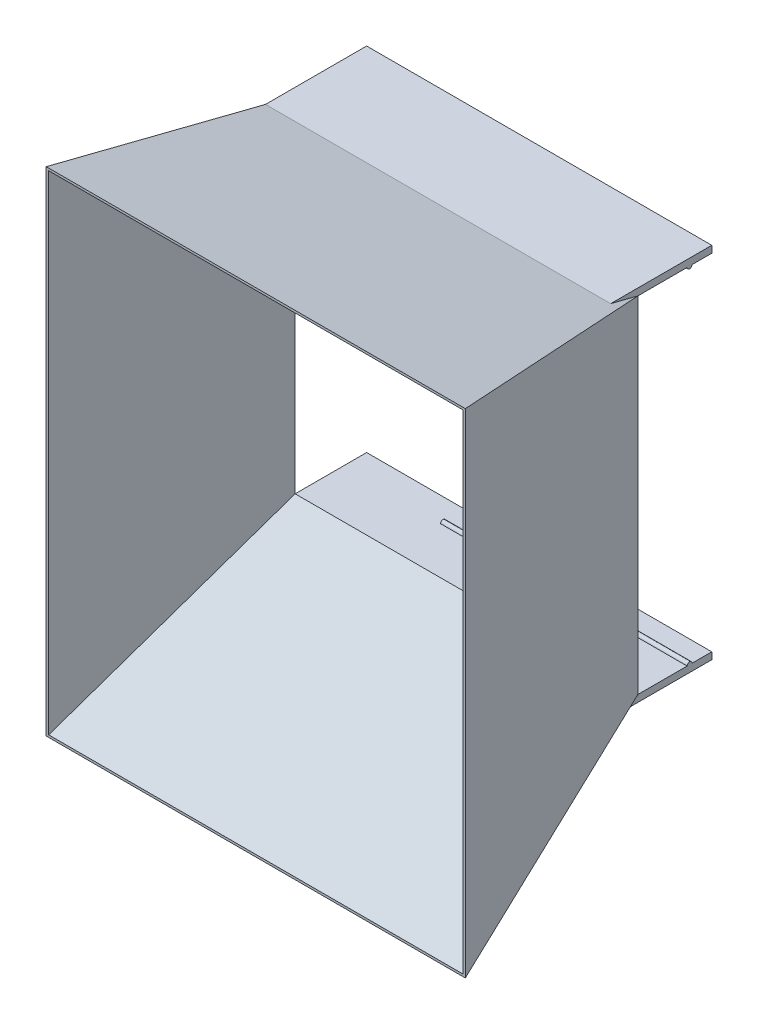
ISO-10303-21;
HEADER;
FILE_DESCRIPTION(('STEP AP214'),'2;1');
FILE_NAME('part.step','',(''),(''),'','','');
FILE_SCHEMA(('AUTOMOTIVE_DESIGN { 1 0 10303 214 1 1 1 1 }'));
ENDSEC;
DATA;
#1=APPLICATION_CONTEXT('core data for automotive mechanical design processes');
#2=APPLICATION_PROTOCOL_DEFINITION('international standard','automotive_design',2000,#1);
#3=PRODUCT_CONTEXT('',#1,'mechanical');
#4=PRODUCT('Part','Part','',(#3));
#5=PRODUCT_RELATED_PRODUCT_CATEGORY('part','',(#4));
#6=PRODUCT_DEFINITION_FORMATION('','',#4);
#7=PRODUCT_DEFINITION_CONTEXT('part definition',#1,'design');
#8=PRODUCT_DEFINITION('design','',#6,#7);
#9=PRODUCT_DEFINITION_SHAPE('','',#8);
#10=(LENGTH_UNIT() NAMED_UNIT(*) SI_UNIT(.MILLI.,.METRE.));
#11=(NAMED_UNIT(*) PLANE_ANGLE_UNIT() SI_UNIT($,.RADIAN.));
#12=(NAMED_UNIT(*) SI_UNIT($,.STERADIAN.) SOLID_ANGLE_UNIT());
#13=UNCERTAINTY_MEASURE_WITH_UNIT(LENGTH_MEASURE(1.E-05),#10,'distance_accuracy_value','');
#14=(GEOMETRIC_REPRESENTATION_CONTEXT(3) GLOBAL_UNCERTAINTY_ASSIGNED_CONTEXT((#13)) GLOBAL_UNIT_ASSIGNED_CONTEXT((#10,
#11,#12)) REPRESENTATION_CONTEXT('',''));
#15=CARTESIAN_POINT('',(0.,0.,0.));
#16=DIRECTION('',(0.,0.,1.));
#17=DIRECTION('',(1.,0.,0.));
#18=AXIS2_PLACEMENT_3D('',#15,#16,#17);
#19=CARTESIAN_POINT('',(91.5811756820604,-69.1091403321492,-30.));
#20=DIRECTION('',(0.,-1.,0.));
#21=DIRECTION('',(0.,0.,-1.));
#22=AXIS2_PLACEMENT_3D('',#19,#20,#21);
#23=PLANE('',#22);
#24=DIRECTION('',(1.,0.,0.));
#25=VECTOR('',#24,1.);
#26=CARTESIAN_POINT('',(-8.41882431793962,-69.1091403321492,-22.));
#27=LINE('',#26,#25);
#28=CARTESIAN_POINT('',(-8.41882431793962,-69.1091403321492,-22.));
#29=VERTEX_POINT('',#28);
#30=CARTESIAN_POINT('',(91.5811756820604,-69.1091403321492,-22.));
#31=VERTEX_POINT('',#30);
#32=EDGE_CURVE('E179',#29,#31,#27,.T.);
#33=ORIENTED_EDGE('',*,*,#32,.T.);
#34=DIRECTION('',(0.,0.,1.));
#35=VECTOR('',#34,1.);
#36=CARTESIAN_POINT('',(91.5811756820604,-69.1091403321492,-30.));
#37=LINE('',#36,#35);
#38=CARTESIAN_POINT('',(91.5811756820604,-69.1091403321492,-30.));
#39=VERTEX_POINT('',#38);
#40=EDGE_CURVE('E215',#39,#31,#37,.T.);
#41=ORIENTED_EDGE('',*,*,#40,.F.);
#42=DIRECTION('',(1.,0.,0.));
#43=VECTOR('',#42,1.);
#44=CARTESIAN_POINT('',(91.5811756820604,-69.1091403321492,-30.));
#45=LINE('',#44,#43);
#46=CARTESIAN_POINT('',(-48.4188243179397,-69.1091403321492,-30.));
#47=VERTEX_POINT('',#46);
#48=EDGE_CURVE('E466',#47,#39,#45,.T.);
#49=ORIENTED_EDGE('',*,*,#48,.F.);
#50=DIRECTION('',(0.,0.,1.));
#51=VECTOR('',#50,1.);
#52=CARTESIAN_POINT('',(-48.4188243179397,-69.1091403321492,-30.));
#53=LINE('',#52,#51);
#54=CARTESIAN_POINT('',(-48.4188243179397,-69.1091403321492,0.));
#55=VERTEX_POINT('',#54);
#56=EDGE_CURVE('E221',#47,#55,#53,.T.);
#57=ORIENTED_EDGE('',*,*,#56,.T.);
#58=DIRECTION('',(1.,0.,0.));
#59=VECTOR('',#58,1.);
#60=CARTESIAN_POINT('',(-48.4188243179397,-69.1091403321492,0.));
#61=LINE('',#60,#59);
#62=CARTESIAN_POINT('',(91.5811756820604,-69.1091403321492,0.));
#63=VERTEX_POINT('',#62);
#64=EDGE_CURVE('E228',#55,#63,#61,.T.);
#65=ORIENTED_EDGE('',*,*,#64,.T.);
#66=CARTESIAN_POINT('',(91.5811756820604,-69.1091403321492,-20.));
#67=VERTEX_POINT('',#66);
#68=EDGE_CURVE('E213',#67,#63,#37,.T.);
#69=ORIENTED_EDGE('',*,*,#68,.F.);
#70=DIRECTION('',(1.,0.,0.));
#71=VECTOR('',#70,1.);
#72=CARTESIAN_POINT('',(-8.41882431793962,-69.1091403321492,-20.));
#73=LINE('',#72,#71);
#74=CARTESIAN_POINT('',(-8.41882431793962,-69.1091403321492,-20.));
#75=VERTEX_POINT('',#74);
#76=EDGE_CURVE('E177',#75,#67,#73,.T.);
#77=ORIENTED_EDGE('',*,*,#76,.F.);
#78=DIRECTION('',(0.,0.,1.));
#79=VECTOR('',#78,1.);
#80=CARTESIAN_POINT('',(-8.41882431793962,-69.1091403321492,0.));
#81=LINE('',#80,#79);
#82=EDGE_CURVE('E175',#29,#75,#81,.T.);
#83=ORIENTED_EDGE('',*,*,#82,.F.);
#84=EDGE_LOOP('',(#33,#41,#49,#57,#65,#69,#77,#83));
#85=FACE_BOUND('',#84,.T.);
#86=ADVANCED_FACE('F17',(#85),#23,.F.);
#87=CARTESIAN_POINT('',(0.,66.5835436528446,-16.9350631505101));
#88=DIRECTION('',(0.,-0.969144043988165,0.246495075006106));
#89=DIRECTION('',(0.,-0.246495075006106,-0.969144043988165));
#90=AXIS2_PLACEMENT_3D('',#87,#88,#89);
#91=PLANE('',#90);
#92=DIRECTION('',(0.,-0.246495075006106,-0.969144043988165));
#93=VECTOR('',#92,1.);
#94=CARTESIAN_POINT('',(91.5811756820604,156.785036138221,337.709909771891));
#95=LINE('',#94,#93);
#96=CARTESIAN_POINT('',(91.5811756820604,73.6908596678508,11.0087527026642));
#97=VERTEX_POINT('',#96);
#98=CARTESIAN_POINT('',(91.5811756820604,70.8908596678508,0.));
#99=VERTEX_POINT('',#98);
#100=EDGE_CURVE('E154',#97,#99,#95,.T.);
#101=ORIENTED_EDGE('',*,*,#100,.F.);
#102=DIRECTION('',(1.,0.,0.));
#103=VECTOR('',#102,1.);
#104=CARTESIAN_POINT('',(91.5811756820605,73.6908596678508,11.0087527026642));
#105=LINE('',#104,#103);
#106=CARTESIAN_POINT('',(-48.4145201388919,73.6908596678508,11.0087527026641));
#107=VERTEX_POINT('',#106);
#108=EDGE_CURVE('E11',#107,#97,#105,.T.);
#109=ORIENTED_EDGE('',*,*,#108,.F.);
#110=DIRECTION('',(0.000378913878947639,0.24649505731075,0.969143974415382));
#111=VECTOR('',#110,1.);
#112=CARTESIAN_POINT('',(-48.4188243179397,70.8908596678508,0.));
#113=LINE('',#112,#111);
#114=CARTESIAN_POINT('',(-48.3797265276267,96.3251670378619,100.));
#115=VERTEX_POINT('',#114);
#116=EDGE_CURVE('E210',#107,#115,#113,.T.);
#117=ORIENTED_EDGE('',*,*,#116,.T.);
#118=CARTESIAN_POINT('',(121.620273472373,96.3251670378619,100.));
#119=DIRECTION('',(-1.,0.,0.));
#120=VECTOR('',#119,1.);
#121=LINE('',#118,#120);
#122=CARTESIAN_POINT('',(121.620273472373,96.3251670378619,100.));
#123=VERTEX_POINT('',#122);
#124=EDGE_CURVE('E28',#123,#115,#121,.T.);
#125=ORIENTED_EDGE('',*,*,#124,.F.);
#126=DIRECTION('',(0.279518120506846,0.236669884098568,0.930514366503328));
#127=VECTOR('',#126,1.);
#128=CARTESIAN_POINT('',(91.5811756820604,70.8908596678508,0.));
#129=LINE('',#128,#127);
#130=EDGE_CURVE('E422',#99,#123,#129,.T.);
#131=ORIENTED_EDGE('',*,*,#130,.F.);
#132=EDGE_LOOP('',(#101,#109,#117,#125,#131));
#133=FACE_BOUND('',#132,.T.);
#134=ADVANCED_FACE('F330',(#133),#91,.F.);
#135=CARTESIAN_POINT('',(0.,-61.7333225470561,-21.338550521895));
#136=DIRECTION('',(0.,0.945131157568779,0.32669113087548));
#137=DIRECTION('',(0.,-0.32669113087548,0.945131157568779));
#138=AXIS2_PLACEMENT_3D('',#135,#136,#137);
#139=PLANE('',#138);
#140=DIRECTION('',(-1.,0.,0.));
#141=VECTOR('',#140,1.);
#142=CARTESIAN_POINT('',(-48.4156600607602,-71.9066063830596,8.09318673534498));
#143=LINE('',#142,#141);
#144=CARTESIAN_POINT('',(91.5811756820604,-71.9066063830596,8.09318673534493));
#145=VERTEX_POINT('',#144);
#146=CARTESIAN_POINT('',(-48.4156600607602,-71.9066063830596,8.09318673534499));
#147=VERTEX_POINT('',#146);
#148=EDGE_CURVE('E473',#145,#147,#143,.T.);
#149=ORIENTED_EDGE('',*,*,#148,.F.);
#150=DIRECTION('',(0.,-0.32669113087548,0.945131157568779));
#151=VECTOR('',#150,1.);
#152=CARTESIAN_POINT('',(91.5811756820604,-158.447475820563,258.459555388468));
#153=LINE('',#152,#151);
#154=EDGE_CURVE('E225',#63,#145,#153,.T.);
#155=ORIENTED_EDGE('',*,*,#154,.F.);
#156=DIRECTION('',(0.273115048369725,-0.314270784045212,0.909198572727438));
#157=VECTOR('',#156,1.);
#158=CARTESIAN_POINT('',(91.5811756820604,-69.1091403321492,0.));
#159=LINE('',#158,#157);
#160=CARTESIAN_POINT('',(121.620273472373,-103.674832962138,100.));
#161=VERTEX_POINT('',#160);
#162=EDGE_CURVE('E425',#63,#161,#159,.T.);
#163=ORIENTED_EDGE('',*,*,#162,.T.);
#164=CARTESIAN_POINT('',(-48.3797265276267,-103.674832962138,100.));
#165=DIRECTION('',(1.,0.,0.));
#166=VECTOR('',#165,1.);
#167=LINE('',#164,#166);
#168=CARTESIAN_POINT('',(-48.3797265276267,-103.674832962138,100.));
#169=VERTEX_POINT('',#168);
#170=EDGE_CURVE('E287',#169,#161,#167,.T.);
#171=ORIENTED_EDGE('',*,*,#170,.F.);
#172=DIRECTION('',(0.000369525372939555,-0.326691108570806,0.945131093040419));
#173=VECTOR('',#172,1.);
#174=CARTESIAN_POINT('',(-48.4188243179397,-69.1091403321492,0.));
#175=LINE('',#174,#173);
#176=EDGE_CURVE('E420',#147,#169,#175,.T.);
#177=ORIENTED_EDGE('',*,*,#176,.F.);
#178=EDGE_LOOP('',(#149,#155,#163,#171,#177));
#179=FACE_BOUND('',#178,.T.);
#180=ADVANCED_FACE('F267',(#179),#139,.F.);
#181=CARTESIAN_POINT('',(0.,0.,100.));
#182=DIRECTION('',(0.,0.,1.));
#183=DIRECTION('',(1.,0.,0.));
#184=AXIS2_PLACEMENT_3D('',#181,#182,#183);
#185=PLANE('',#184);
#186=CARTESIAN_POINT('',(-48.3797265276267,96.3251670378619,100.));
#187=DIRECTION('',(0.,-1.,0.));
#188=VECTOR('',#187,1.);
#189=LINE('',#186,#188);
#190=EDGE_CURVE('E372',#115,#169,#189,.T.);
#191=ORIENTED_EDGE('',*,*,#190,.T.);
#192=ORIENTED_EDGE('',*,*,#170,.T.);
#193=CARTESIAN_POINT('',(121.620273472373,-103.674832962138,100.));
#194=DIRECTION('',(0.,1.,0.));
#195=VECTOR('',#194,1.);
#196=LINE('',#193,#195);
#197=EDGE_CURVE('E301',#161,#123,#196,.T.);
#198=ORIENTED_EDGE('',*,*,#197,.T.);
#199=ORIENTED_EDGE('',*,*,#124,.T.);
#200=EDGE_LOOP('',(#191,#192,#198,#199));
#201=FACE_BOUND('',#200,.T.);
#202=DIRECTION('',(0.,-1.,0.));
#203=VECTOR('',#202,1.);
#204=CARTESIAN_POINT('',(-47.3797265276267,95.4030116528073,100.));
#205=LINE('',#204,#203);
#206=CARTESIAN_POINT('',(-47.3797265276266,95.4030116528073,100.));
#207=VERTEX_POINT('',#206);
#208=CARTESIAN_POINT('',(-47.3797265276267,-102.758617166201,100.));
#209=VERTEX_POINT('',#208);
#210=EDGE_CURVE('E404',#207,#209,#205,.T.);
#211=ORIENTED_EDGE('',*,*,#210,.F.);
#212=DIRECTION('',(-1.,0.,0.));
#213=VECTOR('',#212,1.);
#214=CARTESIAN_POINT('',(120.620273472373,95.4030116528073,100.));
#215=LINE('',#214,#213);
#216=CARTESIAN_POINT('',(120.620273472373,95.4030116528073,100.));
#217=VERTEX_POINT('',#216);
#218=EDGE_CURVE('E412',#217,#207,#215,.T.);
#219=ORIENTED_EDGE('',*,*,#218,.F.);
#220=DIRECTION('',(0.,1.,0.));
#221=VECTOR('',#220,1.);
#222=CARTESIAN_POINT('',(120.620273472373,-102.758617166201,100.));
#223=LINE('',#222,#221);
#224=CARTESIAN_POINT('',(120.620273472373,-102.758617166201,100.));
#225=VERTEX_POINT('',#224);
#226=EDGE_CURVE('E403',#225,#217,#223,.T.);
#227=ORIENTED_EDGE('',*,*,#226,.F.);
#228=DIRECTION('',(1.,0.,0.));
#229=VECTOR('',#228,1.);
#230=CARTESIAN_POINT('',(-47.3797265276267,-102.758617166201,100.));
#231=LINE('',#230,#229);
#232=EDGE_CURVE('E400',#209,#225,#231,.T.);
#233=ORIENTED_EDGE('',*,*,#232,.F.);
#234=EDGE_LOOP('',(#211,#219,#227,#233));
#235=FACE_BOUND('',#234,.T.);
#236=ADVANCED_FACE('F19',(#201,#235),#185,.T.);
#237=CARTESIAN_POINT('',(0.,0.,0.));
#238=DIRECTION('',(0.,0.,1.));
#239=DIRECTION('',(1.,0.,0.));
#240=AXIS2_PLACEMENT_3D('',#237,#238,#239);
#241=PLANE('',#240);
#242=CARTESIAN_POINT('',(91.5811756820604,-69.1091403321492,0.));
#243=DIRECTION('',(0.,1.,0.));
#244=VECTOR('',#243,1.);
#245=LINE('',#242,#244);
#246=EDGE_CURVE('E231',#63,#99,#245,.T.);
#247=ORIENTED_EDGE('',*,*,#246,.F.);
#248=ORIENTED_EDGE('',*,*,#64,.F.);
#249=CARTESIAN_POINT('',(-48.4188243179396,70.8908596678507,0.));
#250=DIRECTION('',(0.,-1.,0.));
#251=VECTOR('',#250,1.);
#252=LINE('',#249,#251);
#253=CARTESIAN_POINT('',(-48.4188243179397,70.8908596678508,0.));
#254=VERTEX_POINT('',#253);
#255=EDGE_CURVE('E211',#254,#55,#252,.T.);
#256=ORIENTED_EDGE('',*,*,#255,.F.);
#257=DIRECTION('',(-1.,0.,0.));
#258=VECTOR('',#257,1.);
#259=CARTESIAN_POINT('',(-48.4188243179397,70.8908596678508,0.));
#260=LINE('',#259,#258);
#261=EDGE_CURVE('E207',#99,#254,#260,.T.);
#262=ORIENTED_EDGE('',*,*,#261,.F.);
#263=EDGE_LOOP('',(#247,#248,#256,#262));
#264=FACE_BOUND('',#263,.T.);
#265=DIRECTION('',(1.,0.,0.));
#266=VECTOR('',#265,1.);
#267=CARTESIAN_POINT('',(-47.4188243179397,69.8908596678508,0.));
#268=LINE('',#267,#266);
#269=CARTESIAN_POINT('',(-47.4188243179397,69.8908596678508,0.));
#270=VERTEX_POINT('',#269);
#271=CARTESIAN_POINT('',(90.5811756820604,69.8908596678508,0.));
#272=VERTEX_POINT('',#271);
#273=EDGE_CURVE('E389',#270,#272,#268,.T.);
#274=ORIENTED_EDGE('',*,*,#273,.F.);
#275=DIRECTION('',(0.,1.,0.));
#276=VECTOR('',#275,1.);
#277=CARTESIAN_POINT('',(-47.4188243179397,-68.1091403321492,0.));
#278=LINE('',#277,#276);
#279=CARTESIAN_POINT('',(-47.4188243179397,-68.1091403321492,0.));
#280=VERTEX_POINT('',#279);
#281=EDGE_CURVE('E384',#280,#270,#278,.T.);
#282=ORIENTED_EDGE('',*,*,#281,.F.);
#283=DIRECTION('',(-1.,0.,0.));
#284=VECTOR('',#283,1.);
#285=CARTESIAN_POINT('',(90.5811756820604,-68.1091403321492,0.));
#286=LINE('',#285,#284);
#287=CARTESIAN_POINT('',(90.5811756820604,-68.1091403321492,0.));
#288=VERTEX_POINT('',#287);
#289=EDGE_CURVE('E376',#288,#280,#286,.T.);
#290=ORIENTED_EDGE('',*,*,#289,.F.);
#291=DIRECTION('',(0.,-1.,0.));
#292=VECTOR('',#291,1.);
#293=CARTESIAN_POINT('',(90.5811756820604,69.8908596678508,0.));
#294=LINE('',#293,#292);
#295=EDGE_CURVE('E385',#272,#288,#294,.T.);
#296=ORIENTED_EDGE('',*,*,#295,.F.);
#297=EDGE_LOOP('',(#274,#282,#290,#296));
#298=FACE_BOUND('',#297,.T.);
#299=ADVANCED_FACE('F319',(#264,#298),#241,.F.);
#300=CARTESIAN_POINT('',(84.0013369186811,0.,-25.2332437421728));
#301=DIRECTION('',(-0.957723164370117,0.,0.287691397905619));
#302=DIRECTION('',(0.287691397905619,0.,0.957723164370117));
#303=AXIS2_PLACEMENT_3D('',#300,#301,#302);
#304=PLANE('',#303);
#305=ORIENTED_EDGE('',*,*,#130,.T.);
#306=ORIENTED_EDGE('',*,*,#197,.F.);
#307=ORIENTED_EDGE('',*,*,#162,.F.);
#308=ORIENTED_EDGE('',*,*,#246,.T.);
#309=EDGE_LOOP('',(#305,#306,#307,#308));
#310=FACE_BOUND('',#309,.T.);
#311=ADVANCED_FACE('F264',(#310),#304,.F.);
#312=CARTESIAN_POINT('',(-48.4188169164591,0.,0.0189306875100145));
#313=DIRECTION('',(0.999999923568148,0.,-0.000390977873246463));
#314=DIRECTION('',(-0.000390977873246463,0.,-0.999999923568148));
#315=AXIS2_PLACEMENT_3D('',#312,#313,#314);
#316=PLANE('',#315);
#317=EDGE_CURVE('E252',#55,#147,#175,.T.);
#318=ORIENTED_EDGE('',*,*,#317,.T.);
#319=ORIENTED_EDGE('',*,*,#176,.T.);
#320=ORIENTED_EDGE('',*,*,#190,.F.);
#321=ORIENTED_EDGE('',*,*,#116,.F.);
#322=EDGE_CURVE('E236',#254,#107,#113,.T.);
#323=ORIENTED_EDGE('',*,*,#322,.F.);
#324=ORIENTED_EDGE('',*,*,#255,.T.);
#325=EDGE_LOOP('',(#318,#319,#320,#321,#323,#324));
#326=FACE_BOUND('',#325,.T.);
#327=ADVANCED_FACE('F254',(#326),#316,.F.);
#328=CARTESIAN_POINT('',(0.,65.6198604726604,-16.7410385361015));
#329=DIRECTION('',(0.,-0.968963594243829,0.247203464842384));
#330=DIRECTION('',(0.,-0.247203464842384,-0.968963594243829));
#331=AXIS2_PLACEMENT_3D('',#328,#329,#330);
#332=PLANE('',#331);
#333=DIRECTION('',(-0.279470140877669,-0.237353490411006,-0.930354642567837));
#334=VECTOR('',#333,1.);
#335=CARTESIAN_POINT('',(120.620273472373,95.4030116528073,100.));
#336=LINE('',#335,#334);
#337=EDGE_CURVE('E408',#217,#272,#336,.T.);
#338=ORIENTED_EDGE('',*,*,#337,.F.);
#339=ORIENTED_EDGE('',*,*,#218,.T.);
#340=DIRECTION('',(-0.00037884332710017,-0.247203447102782,-0.968963524709901));
#341=VECTOR('',#340,1.);
#342=CARTESIAN_POINT('',(-47.3797265276267,95.4030116528073,100.));
#343=LINE('',#342,#341);
#344=EDGE_CURVE('E482',#207,#270,#343,.T.);
#345=ORIENTED_EDGE('',*,*,#344,.T.);
#346=ORIENTED_EDGE('',*,*,#273,.T.);
#347=EDGE_LOOP('',(#338,#339,#345,#346));
#348=FACE_BOUND('',#347,.T.);
#349=ADVANCED_FACE('F263',(#348),#332,.T.);
#350=CARTESIAN_POINT('',(-47.4188170693228,0.,0.0185397096666512));
#351=DIRECTION('',(0.999999923568148,0.,-0.000390977873246462));
#352=DIRECTION('',(-0.000390977873246462,0.,-0.999999923568148));
#353=AXIS2_PLACEMENT_3D('',#350,#351,#352);
#354=PLANE('',#353);
#355=ORIENTED_EDGE('',*,*,#344,.F.);
#356=ORIENTED_EDGE('',*,*,#210,.T.);
#357=DIRECTION('',(-0.000369429699119534,0.327398190511266,-0.944886389134507));
#358=VECTOR('',#357,1.);
#359=CARTESIAN_POINT('',(-47.3797265276267,-102.758617166201,100.));
#360=LINE('',#359,#358);
#361=EDGE_CURVE('E397',#209,#280,#360,.T.);
#362=ORIENTED_EDGE('',*,*,#361,.T.);
#363=ORIENTED_EDGE('',*,*,#281,.T.);
#364=EDGE_LOOP('',(#355,#356,#362,#363));
#365=FACE_BOUND('',#364,.T.);
#366=ADVANCED_FACE('F526',(#365),#354,.T.);
#367=CARTESIAN_POINT('',(83.0841032591099,0.,-24.9577150262086));
#368=DIRECTION('',(-0.957723164370117,0.,0.28769139790562));
#369=DIRECTION('',(0.28769139790562,0.,0.957723164370117));
#370=AXIS2_PLACEMENT_3D('',#367,#368,#369);
#371=PLANE('',#370);
#372=DIRECTION('',(-0.273049608797816,0.314957065642556,-0.908980724733583));
#373=VECTOR('',#372,1.);
#374=CARTESIAN_POINT('',(120.620273472373,-102.758617166201,100.));
#375=LINE('',#374,#373);
#376=EDGE_CURVE('E479',#225,#288,#375,.T.);
#377=ORIENTED_EDGE('',*,*,#376,.F.);
#378=ORIENTED_EDGE('',*,*,#226,.T.);
#379=ORIENTED_EDGE('',*,*,#337,.T.);
#380=ORIENTED_EDGE('',*,*,#295,.T.);
#381=EDGE_LOOP('',(#377,#378,#379,#380));
#382=FACE_BOUND('',#381,.T.);
#383=ADVANCED_FACE('F529',(#382),#371,.T.);
#384=CARTESIAN_POINT('',(0.,-60.8085495197387,-21.0698442789646));
#385=DIRECTION('',(0.,0.944886453612758,0.327398212852644));
#386=DIRECTION('',(0.,-0.327398212852644,0.944886453612758));
#387=AXIS2_PLACEMENT_3D('',#384,#385,#386);
#388=PLANE('',#387);
#389=ORIENTED_EDGE('',*,*,#361,.F.);
#390=ORIENTED_EDGE('',*,*,#232,.T.);
#391=ORIENTED_EDGE('',*,*,#376,.T.);
#392=ORIENTED_EDGE('',*,*,#289,.T.);
#393=EDGE_LOOP('',(#389,#390,#391,#392));
#394=FACE_BOUND('',#393,.T.);
#395=ADVANCED_FACE('F328',(#394),#388,.T.);
#396=CARTESIAN_POINT('',(91.5811756820604,-71.9066063830596,288.373006317555));
#397=DIRECTION('',(1.,0.,0.));
#398=DIRECTION('',(0.,0.,-1.));
#399=AXIS2_PLACEMENT_3D('',#396,#397,#398);
#400=PLANE('',#399);
#401=DIRECTION('',(0.,0.,-1.));
#402=VECTOR('',#401,1.);
#403=CARTESIAN_POINT('',(91.5811756820604,-71.9066063830596,288.373006317555));
#404=LINE('',#403,#402);
#405=CARTESIAN_POINT('',(91.5811756820604,-71.9066063830596,-30.));
#406=VERTEX_POINT('',#405);
#407=EDGE_CURVE('E476',#145,#406,#404,.T.);
#408=ORIENTED_EDGE('',*,*,#407,.T.);
#409=DIRECTION('',(0.,-1.,0.));
#410=VECTOR('',#409,1.);
#411=CARTESIAN_POINT('',(91.5811756820604,-71.9066063830596,-30.));
#412=LINE('',#411,#410);
#413=EDGE_CURVE('E468',#39,#406,#412,.T.);
#414=ORIENTED_EDGE('',*,*,#413,.F.);
#415=ORIENTED_EDGE('',*,*,#40,.T.);
#416=CARTESIAN_POINT('',(91.5811756820604,-69.1091403321492,-21.));
#417=DIRECTION('',(1.,0.,0.));
#418=DIRECTION('',(0.,0.,-1.));
#419=AXIS2_PLACEMENT_3D('',#416,#417,#418);
#420=CIRCLE('',#419,1.);
#421=EDGE_CURVE('E171',#67,#31,#420,.F.);
#422=ORIENTED_EDGE('',*,*,#421,.F.);
#423=ORIENTED_EDGE('',*,*,#68,.T.);
#424=ORIENTED_EDGE('',*,*,#154,.T.);
#425=EDGE_LOOP('',(#408,#414,#415,#422,#423,#424));
#426=FACE_BOUND('',#425,.T.);
#427=ADVANCED_FACE('F519',(#426),#400,.T.);
#428=CARTESIAN_POINT('',(-48.4156600607602,-71.9066063830596,288.373006317555));
#429=DIRECTION('',(0.,-1.,0.));
#430=DIRECTION('',(0.,0.,-1.));
#431=AXIS2_PLACEMENT_3D('',#428,#429,#430);
#432=PLANE('',#431);
#433=ORIENTED_EDGE('',*,*,#407,.F.);
#434=ORIENTED_EDGE('',*,*,#148,.T.);
#435=DIRECTION('',(0.,0.,-1.));
#436=VECTOR('',#435,1.);
#437=CARTESIAN_POINT('',(-48.4156600607602,-71.9066063830596,288.373006317555));
#438=LINE('',#437,#436);
#439=CARTESIAN_POINT('',(-48.4156600607602,-71.9066063830596,-30.));
#440=VERTEX_POINT('',#439);
#441=EDGE_CURVE('E417',#147,#440,#438,.T.);
#442=ORIENTED_EDGE('',*,*,#441,.T.);
#443=DIRECTION('',(-1.,0.,0.));
#444=VECTOR('',#443,1.);
#445=CARTESIAN_POINT('',(-48.4156600607602,-71.9066063830596,-30.));
#446=LINE('',#445,#444);
#447=EDGE_CURVE('E216',#406,#440,#446,.T.);
#448=ORIENTED_EDGE('',*,*,#447,.F.);
#449=EDGE_LOOP('',(#433,#434,#442,#448));
#450=FACE_BOUND('',#449,.T.);
#451=ADVANCED_FACE('F515',(#450),#432,.T.);
#452=CARTESIAN_POINT('',(-48.4188243179397,-69.1091403321492,288.373006317555));
#453=DIRECTION('',(-0.999999360289489,-0.0011311147651587,0.));
#454=DIRECTION('',(0.0011311147651587,-0.99999936028949,0.));
#455=AXIS2_PLACEMENT_3D('',#452,#453,#454);
#456=PLANE('',#455);
#457=ORIENTED_EDGE('',*,*,#441,.F.);
#458=ORIENTED_EDGE('',*,*,#317,.F.);
#459=ORIENTED_EDGE('',*,*,#56,.F.);
#460=DIRECTION('',(-0.0011311147651587,0.999999360289489,0.));
#461=VECTOR('',#460,1.);
#462=CARTESIAN_POINT('',(-48.4188243179397,-69.1091403321492,-30.));
#463=LINE('',#462,#461);
#464=EDGE_CURVE('E200',#440,#47,#463,.T.);
#465=ORIENTED_EDGE('',*,*,#464,.F.);
#466=EDGE_LOOP('',(#457,#458,#459,#465));
#467=FACE_BOUND('',#466,.T.);
#468=ADVANCED_FACE('F512',(#467),#456,.T.);
#469=CARTESIAN_POINT('',(0.,0.,-30.));
#470=DIRECTION('',(0.,0.,1.));
#471=DIRECTION('',(1.,0.,0.));
#472=AXIS2_PLACEMENT_3D('',#469,#470,#471);
#473=PLANE('',#472);
#474=ORIENTED_EDGE('',*,*,#464,.T.);
#475=ORIENTED_EDGE('',*,*,#48,.T.);
#476=ORIENTED_EDGE('',*,*,#413,.T.);
#477=ORIENTED_EDGE('',*,*,#447,.T.);
#478=EDGE_LOOP('',(#474,#475,#476,#477));
#479=FACE_BOUND('',#478,.T.);
#480=ADVANCED_FACE('F510',(#479),#473,.F.);
#481=CARTESIAN_POINT('',(0.,66.5835436528446,-16.9350631505101));
#482=DIRECTION('',(0.,-0.969144043988165,0.246495075006106));
#483=DIRECTION('',(0.,-0.246495075006106,-0.969144043988165));
#484=AXIS2_PLACEMENT_3D('',#481,#482,#483);
#485=PLANE('',#484);
#486=DIRECTION('',(0.,0.246495075006106,0.969144043988165));
#487=VECTOR('',#486,1.);
#488=CARTESIAN_POINT('',(-48.4188243179397,156.785036138221,337.709909771891));
#489=LINE('',#488,#487);
#490=CARTESIAN_POINT('',(-48.4188243179397,73.6908596678508,11.0087527026642));
#491=VERTEX_POINT('',#490);
#492=EDGE_CURVE('E204',#254,#491,#489,.T.);
#493=ORIENTED_EDGE('',*,*,#492,.F.);
#494=ORIENTED_EDGE('',*,*,#322,.T.);
#495=EDGE_CURVE('E30',#491,#107,#105,.T.);
#496=ORIENTED_EDGE('',*,*,#495,.F.);
#497=EDGE_LOOP('',(#493,#494,#496));
#498=FACE_BOUND('',#497,.T.);
#499=ADVANCED_FACE('F453',(#498),#485,.T.);
#500=CARTESIAN_POINT('',(-48.4188243179397,70.8908596678508,359.556498628304));
#501=DIRECTION('',(-1.,0.,0.));
#502=DIRECTION('',(0.,0.,1.));
#503=AXIS2_PLACEMENT_3D('',#500,#501,#502);
#504=PLANE('',#503);
#505=DIRECTION('',(0.,0.,-1.));
#506=VECTOR('',#505,1.);
#507=CARTESIAN_POINT('',(-48.4188243179397,73.6908596678508,359.556498628304));
#508=LINE('',#507,#506);
#509=CARTESIAN_POINT('',(-48.4188243179397,73.6908596678508,-30.));
#510=VERTEX_POINT('',#509);
#511=EDGE_CURVE('E459',#491,#510,#508,.T.);
#512=ORIENTED_EDGE('',*,*,#511,.T.);
#513=DIRECTION('',(0.,1.,0.));
#514=VECTOR('',#513,1.);
#515=CARTESIAN_POINT('',(-48.4188243179397,70.8908596678508,-30.));
#516=LINE('',#515,#514);
#517=CARTESIAN_POINT('',(-48.4188243179397,70.8908596678508,-30.));
#518=VERTEX_POINT('',#517);
#519=EDGE_CURVE('E189',#518,#510,#516,.T.);
#520=ORIENTED_EDGE('',*,*,#519,.F.);
#521=DIRECTION('',(0.,0.,1.));
#522=VECTOR('',#521,1.);
#523=CARTESIAN_POINT('',(-48.4188243179397,70.8908596678508,-30.));
#524=LINE('',#523,#522);
#525=EDGE_CURVE('E158',#518,#254,#524,.T.);
#526=ORIENTED_EDGE('',*,*,#525,.T.);
#527=ORIENTED_EDGE('',*,*,#492,.T.);
#528=EDGE_LOOP('',(#512,#520,#526,#527));
#529=FACE_BOUND('',#528,.T.);
#530=ADVANCED_FACE('F601',(#529),#504,.T.);
#531=CARTESIAN_POINT('',(91.5811756820604,73.6908596678508,359.556498628304));
#532=DIRECTION('',(0.,1.,0.));
#533=DIRECTION('',(0.,0.,1.));
#534=AXIS2_PLACEMENT_3D('',#531,#532,#533);
#535=PLANE('',#534);
#536=ORIENTED_EDGE('',*,*,#511,.F.);
#537=ORIENTED_EDGE('',*,*,#495,.T.);
#538=ORIENTED_EDGE('',*,*,#108,.T.);
#539=DIRECTION('',(0.,0.,-1.));
#540=VECTOR('',#539,1.);
#541=CARTESIAN_POINT('',(91.5811756820604,73.6908596678508,359.556498628304));
#542=LINE('',#541,#540);
#543=CARTESIAN_POINT('',(91.5811756820604,73.6908596678508,-30.));
#544=VERTEX_POINT('',#543);
#545=EDGE_CURVE('E201',#97,#544,#542,.T.);
#546=ORIENTED_EDGE('',*,*,#545,.T.);
#547=DIRECTION('',(1.,0.,0.));
#548=VECTOR('',#547,1.);
#549=CARTESIAN_POINT('',(91.5811756820604,73.6908596678508,-30.));
#550=LINE('',#549,#548);
#551=EDGE_CURVE('E192',#510,#544,#550,.T.);
#552=ORIENTED_EDGE('',*,*,#551,.F.);
#553=EDGE_LOOP('',(#536,#537,#538,#546,#552));
#554=FACE_BOUND('',#553,.T.);
#555=ADVANCED_FACE('F457',(#554),#535,.T.);
#556=CARTESIAN_POINT('',(91.5811756820604,70.8908596678508,359.556498628304));
#557=DIRECTION('',(1.,0.,0.));
#558=DIRECTION('',(0.,0.,-1.));
#559=AXIS2_PLACEMENT_3D('',#556,#557,#558);
#560=PLANE('',#559);
#561=ORIENTED_EDGE('',*,*,#545,.F.);
#562=ORIENTED_EDGE('',*,*,#100,.T.);
#563=DIRECTION('',(0.,0.,1.));
#564=VECTOR('',#563,1.);
#565=CARTESIAN_POINT('',(91.5811756820604,70.8908596678508,-30.));
#566=LINE('',#565,#564);
#567=CARTESIAN_POINT('',(91.5811756820604,70.8908596678508,-20.));
#568=VERTEX_POINT('',#567);
#569=EDGE_CURVE('E22',#568,#99,#566,.T.);
#570=ORIENTED_EDGE('',*,*,#569,.F.);
#571=CARTESIAN_POINT('',(91.5811756820604,70.8908596678508,-21.));
#572=DIRECTION('',(1.,0.,0.));
#573=DIRECTION('',(0.,0.,-1.));
#574=AXIS2_PLACEMENT_3D('',#571,#572,#573);
#575=CIRCLE('',#574,1.);
#576=CARTESIAN_POINT('',(91.5811756820604,70.8908596678508,-22.));
#577=VERTEX_POINT('',#576);
#578=EDGE_CURVE('E153',#568,#577,#575,.T.);
#579=ORIENTED_EDGE('',*,*,#578,.T.);
#580=CARTESIAN_POINT('',(91.5811756820604,70.8908596678508,-30.));
#581=VERTEX_POINT('',#580);
#582=EDGE_CURVE('E157',#581,#577,#566,.T.);
#583=ORIENTED_EDGE('',*,*,#582,.F.);
#584=DIRECTION('',(0.,-1.,0.));
#585=VECTOR('',#584,1.);
#586=CARTESIAN_POINT('',(91.5811756820604,70.8908596678508,-30.));
#587=LINE('',#586,#585);
#588=EDGE_CURVE('E182',#544,#581,#587,.T.);
#589=ORIENTED_EDGE('',*,*,#588,.F.);
#590=EDGE_LOOP('',(#561,#562,#570,#579,#583,#589));
#591=FACE_BOUND('',#590,.T.);
#592=ADVANCED_FACE('F150',(#591),#560,.T.);
#593=CARTESIAN_POINT('',(91.5811756820604,70.8908596678508,-30.));
#594=DIRECTION('',(0.,1.,0.));
#595=DIRECTION('',(0.,0.,1.));
#596=AXIS2_PLACEMENT_3D('',#593,#594,#595);
#597=PLANE('',#596);
#598=DIRECTION('',(0.,0.,-1.));
#599=VECTOR('',#598,1.);
#600=CARTESIAN_POINT('',(-8.41882431793962,70.8908596678508,0.));
#601=LINE('',#600,#599);
#602=CARTESIAN_POINT('',(-8.41882431793962,70.8908596678508,-20.));
#603=VERTEX_POINT('',#602);
#604=CARTESIAN_POINT('',(-8.41882431793962,70.8908596678508,-22.));
#605=VERTEX_POINT('',#604);
#606=EDGE_CURVE('E41',#603,#605,#601,.T.);
#607=ORIENTED_EDGE('',*,*,#606,.F.);
#608=DIRECTION('',(1.,0.,0.));
#609=VECTOR('',#608,1.);
#610=CARTESIAN_POINT('',(-8.41882431793962,70.8908596678508,-20.));
#611=LINE('',#610,#609);
#612=EDGE_CURVE('E159',#603,#568,#611,.T.);
#613=ORIENTED_EDGE('',*,*,#612,.T.);
#614=ORIENTED_EDGE('',*,*,#569,.T.);
#615=ORIENTED_EDGE('',*,*,#261,.T.);
#616=ORIENTED_EDGE('',*,*,#525,.F.);
#617=DIRECTION('',(-1.,0.,0.));
#618=VECTOR('',#617,1.);
#619=CARTESIAN_POINT('',(91.5811756820604,70.8908596678508,-30.));
#620=LINE('',#619,#618);
#621=EDGE_CURVE('E187',#581,#518,#620,.T.);
#622=ORIENTED_EDGE('',*,*,#621,.F.);
#623=ORIENTED_EDGE('',*,*,#582,.T.);
#624=DIRECTION('',(1.,0.,0.));
#625=VECTOR('',#624,1.);
#626=CARTESIAN_POINT('',(-8.41882431793962,70.8908596678508,-22.));
#627=LINE('',#626,#625);
#628=EDGE_CURVE('E37',#605,#577,#627,.T.);
#629=ORIENTED_EDGE('',*,*,#628,.F.);
#630=EDGE_LOOP('',(#607,#613,#614,#615,#616,#622,#623,#629));
#631=FACE_BOUND('',#630,.T.);
#632=ADVANCED_FACE('F160',(#631),#597,.F.);
#633=CARTESIAN_POINT('',(0.,0.,-30.));
#634=DIRECTION('',(0.,0.,1.));
#635=DIRECTION('',(1.,0.,0.));
#636=AXIS2_PLACEMENT_3D('',#633,#634,#635);
#637=PLANE('',#636);
#638=ORIENTED_EDGE('',*,*,#588,.T.);
#639=ORIENTED_EDGE('',*,*,#621,.T.);
#640=ORIENTED_EDGE('',*,*,#519,.T.);
#641=ORIENTED_EDGE('',*,*,#551,.T.);
#642=EDGE_LOOP('',(#638,#639,#640,#641));
#643=FACE_BOUND('',#642,.T.);
#644=ADVANCED_FACE('F588',(#643),#637,.F.);
#645=CARTESIAN_POINT('',(-8.41882431793962,-69.1091403321492,-21.));
#646=DIRECTION('',(1.,0.,0.));
#647=DIRECTION('',(0.,0.,-1.));
#648=AXIS2_PLACEMENT_3D('',#645,#646,#647);
#649=CYLINDRICAL_SURFACE('',#648,1.);
#650=ORIENTED_EDGE('',*,*,#421,.T.);
#651=ORIENTED_EDGE('',*,*,#32,.F.);
#652=CARTESIAN_POINT('',(-8.41882431793962,-69.1091403321492,-21.));
#653=DIRECTION('',(1.,0.,0.));
#654=DIRECTION('',(0.,0.,-1.));
#655=AXIS2_PLACEMENT_3D('',#652,#653,#654);
#656=CIRCLE('',#655,1.);
#657=EDGE_CURVE('E173',#75,#29,#656,.F.);
#658=ORIENTED_EDGE('',*,*,#657,.F.);
#659=ORIENTED_EDGE('',*,*,#76,.T.);
#660=EDGE_LOOP('',(#650,#651,#658,#659));
#661=FACE_BOUND('',#660,.T.);
#662=ADVANCED_FACE('F576',(#661),#649,.T.);
#663=CARTESIAN_POINT('',(-8.41882431793962,0.,0.));
#664=DIRECTION('',(1.,0.,0.));
#665=DIRECTION('',(0.,0.,-1.));
#666=AXIS2_PLACEMENT_3D('',#663,#664,#665);
#667=PLANE('',#666);
#668=ORIENTED_EDGE('',*,*,#657,.T.);
#669=ORIENTED_EDGE('',*,*,#82,.T.);
#670=EDGE_LOOP('',(#668,#669));
#671=FACE_BOUND('',#670,.T.);
#672=ADVANCED_FACE('F578',(#671),#667,.F.);
#673=CARTESIAN_POINT('',(-8.41882431793962,70.8908596678508,-21.));
#674=DIRECTION('',(1.,0.,0.));
#675=DIRECTION('',(0.,0.,-1.));
#676=AXIS2_PLACEMENT_3D('',#673,#674,#675);
#677=CYLINDRICAL_SURFACE('',#676,1.);
#678=ORIENTED_EDGE('',*,*,#578,.F.);
#679=ORIENTED_EDGE('',*,*,#612,.F.);
#680=CARTESIAN_POINT('',(-8.41882431793962,70.8908596678508,-21.));
#681=DIRECTION('',(1.,0.,0.));
#682=DIRECTION('',(0.,0.,-1.));
#683=AXIS2_PLACEMENT_3D('',#680,#681,#682);
#684=CIRCLE('',#683,1.);
#685=EDGE_CURVE('E164',#603,#605,#684,.T.);
#686=ORIENTED_EDGE('',*,*,#685,.T.);
#687=ORIENTED_EDGE('',*,*,#628,.T.);
#688=EDGE_LOOP('',(#678,#679,#686,#687));
#689=FACE_BOUND('',#688,.T.);
#690=ADVANCED_FACE('F166',(#689),#677,.T.);
#691=CARTESIAN_POINT('',(-8.41882431793962,0.,0.));
#692=DIRECTION('',(1.,0.,0.));
#693=DIRECTION('',(0.,0.,-1.));
#694=AXIS2_PLACEMENT_3D('',#691,#692,#693);
#695=PLANE('',#694);
#696=ORIENTED_EDGE('',*,*,#606,.T.);
#697=ORIENTED_EDGE('',*,*,#685,.F.);
#698=EDGE_LOOP('',(#696,#697));
#699=FACE_BOUND('',#698,.T.);
#700=ADVANCED_FACE('F586',(#699),#695,.F.);
#701=CLOSED_SHELL('',(#86,#134,#180,#236,#299,#311,#327,#349,#366,#383,#395,#427,#451,#468,#480,
#499,#530,#555,#592,#632,#644,#662,#672,#690,#700));
#702=MANIFOLD_SOLID_BREP('B1',#701);
#703=ADVANCED_BREP_SHAPE_REPRESENTATION('',(#18,#702),#14);
#704=SHAPE_DEFINITION_REPRESENTATION(#9,#703);
ENDSEC;
END-ISO-10303-21;
